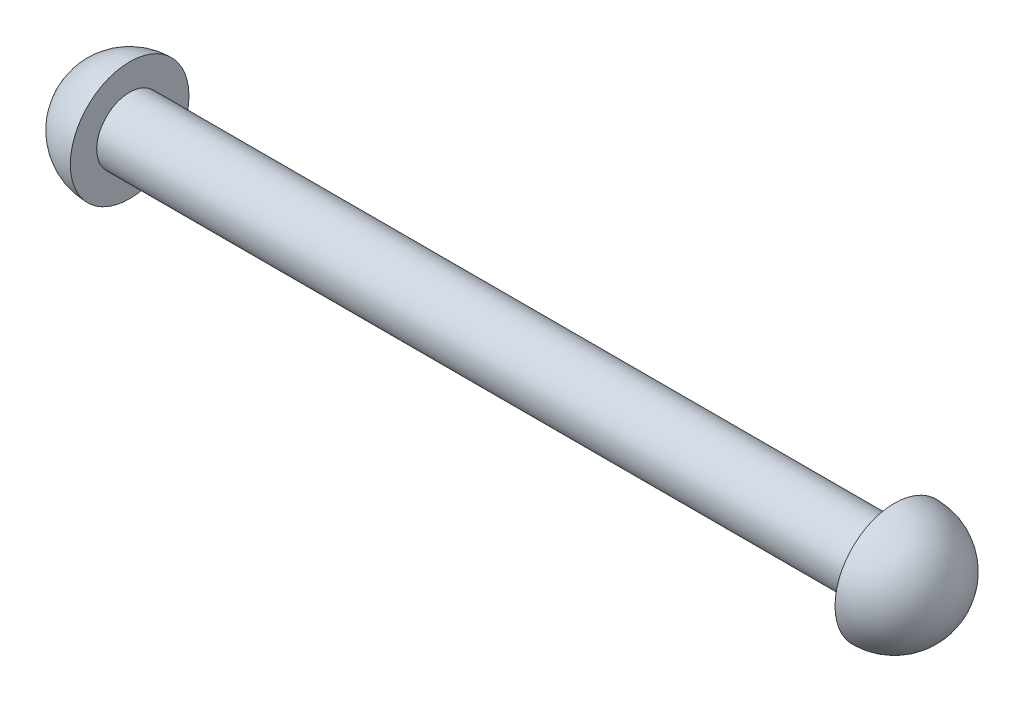
ISO-10303-21;
HEADER;
FILE_DESCRIPTION(('STEP AP214'),'2;1');
FILE_NAME('part.step','',(''),(''),'','','');
FILE_SCHEMA(('AUTOMOTIVE_DESIGN { 1 0 10303 214 1 1 1 1 }'));
ENDSEC;
DATA;
#1=APPLICATION_CONTEXT('core data for automotive mechanical design processes');
#2=APPLICATION_PROTOCOL_DEFINITION('international standard','automotive_design',2000,#1);
#3=PRODUCT_CONTEXT('',#1,'mechanical');
#4=PRODUCT('Part','Part','',(#3));
#5=PRODUCT_RELATED_PRODUCT_CATEGORY('part','',(#4));
#6=PRODUCT_DEFINITION_FORMATION('','',#4);
#7=PRODUCT_DEFINITION_CONTEXT('part definition',#1,'design');
#8=PRODUCT_DEFINITION('design','',#6,#7);
#9=PRODUCT_DEFINITION_SHAPE('','',#8);
#10=(LENGTH_UNIT() NAMED_UNIT(*) SI_UNIT(.MILLI.,.METRE.));
#11=(NAMED_UNIT(*) PLANE_ANGLE_UNIT() SI_UNIT($,.RADIAN.));
#12=(NAMED_UNIT(*) SI_UNIT($,.STERADIAN.) SOLID_ANGLE_UNIT());
#13=UNCERTAINTY_MEASURE_WITH_UNIT(LENGTH_MEASURE(1.E-05),#10,'distance_accuracy_value','');
#14=(GEOMETRIC_REPRESENTATION_CONTEXT(3) GLOBAL_UNCERTAINTY_ASSIGNED_CONTEXT((#13)) GLOBAL_UNIT_ASSIGNED_CONTEXT((#10,
#11,#12)) REPRESENTATION_CONTEXT('',''));
#15=CARTESIAN_POINT('',(0.,0.,0.));
#16=DIRECTION('',(0.,0.,1.));
#17=DIRECTION('',(1.,0.,0.));
#18=AXIS2_PLACEMENT_3D('',#15,#16,#17);
#19=CARTESIAN_POINT('',(5.715,0.,0.));
#20=DIRECTION('',(-1.,0.,0.));
#21=DIRECTION('',(0.,1.,0.));
#22=AXIS2_PLACEMENT_3D('',#19,#20,#21);
#23=SPHERICAL_SURFACE('',#22,5.715);
#24=CARTESIAN_POINT('',(5.715,0.,0.));
#25=DIRECTION('',(-1.,0.,0.));
#26=DIRECTION('',(0.,-1.,0.));
#27=AXIS2_PLACEMENT_3D('',#24,#25,#26);
#28=CIRCLE('',#27,5.715);
#29=CARTESIAN_POINT('',(5.715,-5.715,0.));
#30=VERTEX_POINT('',#29);
#31=EDGE_CURVE('E10',#30,#30,#28,.T.);
#32=ORIENTED_EDGE('',*,*,#31,.T.);
#33=EDGE_LOOP('',(#32));
#34=FACE_BOUND('',#33,.T.);
#35=ADVANCED_FACE('F43',(#34),#23,.T.);
#36=CARTESIAN_POINT('',(5.715,5.715,0.));
#37=DIRECTION('',(-1.,0.,0.));
#38=DIRECTION('',(0.,-1.,0.));
#39=AXIS2_PLACEMENT_3D('',#36,#37,#38);
#40=PLANE('',#39);
#41=ORIENTED_EDGE('',*,*,#31,.F.);
#42=EDGE_LOOP('',(#41));
#43=FACE_BOUND('',#42,.T.);
#44=CARTESIAN_POINT('',(5.715,0.,0.));
#45=DIRECTION('',(-1.,0.,0.));
#46=DIRECTION('',(0.,-1.,0.));
#47=AXIS2_PLACEMENT_3D('',#44,#45,#46);
#48=CIRCLE('',#47,3.175);
#49=CARTESIAN_POINT('',(5.715,-3.175,0.));
#50=VERTEX_POINT('',#49);
#51=EDGE_CURVE('E50',#50,#50,#48,.T.);
#52=ORIENTED_EDGE('',*,*,#51,.T.);
#53=EDGE_LOOP('',(#52));
#54=FACE_BOUND('',#53,.T.);
#55=ADVANCED_FACE('F79',(#43,#54),#40,.F.);
#56=CARTESIAN_POINT('',(0.,0.,0.));
#57=DIRECTION('',(-1.,0.,0.));
#58=DIRECTION('',(0.,-1.,0.));
#59=AXIS2_PLACEMENT_3D('',#56,#57,#58);
#60=CYLINDRICAL_SURFACE('',#59,3.175);
#61=ORIENTED_EDGE('',*,*,#51,.F.);
#62=EDGE_LOOP('',(#61));
#63=FACE_BOUND('',#62,.T.);
#64=CARTESIAN_POINT('',(79.375,0.,0.));
#65=DIRECTION('',(-1.,0.,0.));
#66=DIRECTION('',(0.,-1.,0.));
#67=AXIS2_PLACEMENT_3D('',#64,#65,#66);
#68=CIRCLE('',#67,3.175);
#69=CARTESIAN_POINT('',(79.375,-3.17499999999999,0.));
#70=VERTEX_POINT('',#69);
#71=EDGE_CURVE('E55',#70,#70,#68,.T.);
#72=ORIENTED_EDGE('',*,*,#71,.T.);
#73=EDGE_LOOP('',(#72));
#74=FACE_BOUND('',#73,.T.);
#75=ADVANCED_FACE('F75',(#63,#74),#60,.T.);
#76=CARTESIAN_POINT('',(79.375,5.71500000000001,0.));
#77=DIRECTION('',(1.,0.,0.));
#78=DIRECTION('',(0.,1.,0.));
#79=AXIS2_PLACEMENT_3D('',#76,#77,#78);
#80=PLANE('',#79);
#81=ORIENTED_EDGE('',*,*,#71,.F.);
#82=EDGE_LOOP('',(#81));
#83=FACE_BOUND('',#82,.T.);
#84=CARTESIAN_POINT('',(79.375,0.,0.));
#85=DIRECTION('',(-1.,0.,0.));
#86=DIRECTION('',(0.,-1.,0.));
#87=AXIS2_PLACEMENT_3D('',#84,#85,#86);
#88=CIRCLE('',#87,5.715);
#89=CARTESIAN_POINT('',(79.375,-5.71499999999999,0.));
#90=VERTEX_POINT('',#89);
#91=EDGE_CURVE('E60',#90,#90,#88,.T.);
#92=ORIENTED_EDGE('',*,*,#91,.T.);
#93=EDGE_LOOP('',(#92));
#94=FACE_BOUND('',#93,.T.);
#95=ADVANCED_FACE('F67',(#83,#94),#80,.F.);
#96=CARTESIAN_POINT('',(79.375,0.,0.));
#97=DIRECTION('',(-1.,0.,0.));
#98=DIRECTION('',(0.,1.,0.));
#99=AXIS2_PLACEMENT_3D('',#96,#97,#98);
#100=SPHERICAL_SURFACE('',#99,5.715);
#101=ORIENTED_EDGE('',*,*,#91,.F.);
#102=EDGE_LOOP('',(#101));
#103=FACE_BOUND('',#102,.T.);
#104=ADVANCED_FACE('F69',(#103),#100,.T.);
#105=CLOSED_SHELL('',(#35,#55,#75,#95,#104));
#106=MANIFOLD_SOLID_BREP('B2',#105);
#107=ADVANCED_BREP_SHAPE_REPRESENTATION('',(#18,#106),#14);
#108=SHAPE_DEFINITION_REPRESENTATION(#9,#107);
ENDSEC;
END-ISO-10303-21;
